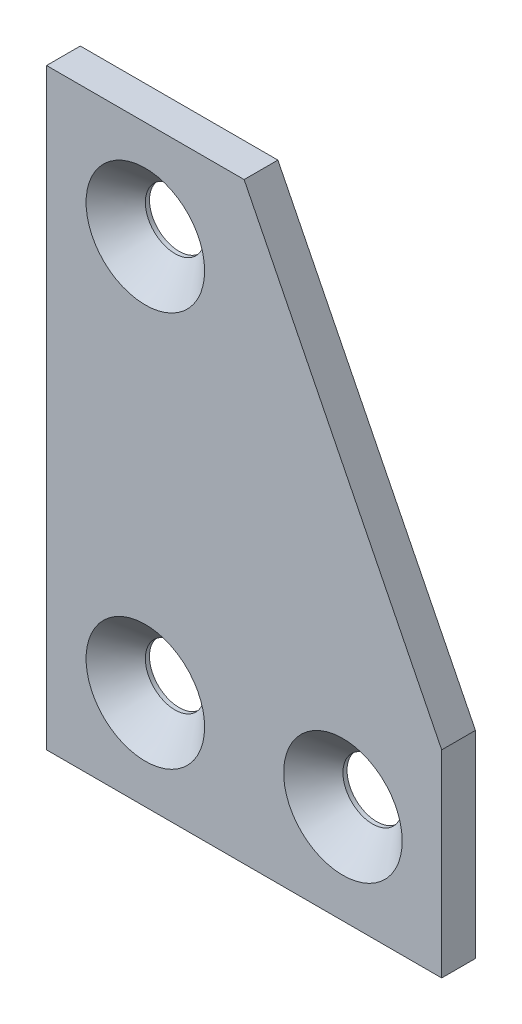
ISO-10303-21;
HEADER;
FILE_DESCRIPTION(('STEP AP214'),'2;1');
FILE_NAME('part.step','',(''),(''),'','','');
FILE_SCHEMA(('AUTOMOTIVE_DESIGN { 1 0 10303 214 1 1 1 1 }'));
ENDSEC;
DATA;
#1=APPLICATION_CONTEXT('core data for automotive mechanical design processes');
#2=APPLICATION_PROTOCOL_DEFINITION('international standard','automotive_design',2000,#1);
#3=PRODUCT_CONTEXT('',#1,'mechanical');
#4=PRODUCT('Part','Part','',(#3));
#5=PRODUCT_RELATED_PRODUCT_CATEGORY('part','',(#4));
#6=PRODUCT_DEFINITION_FORMATION('','',#4);
#7=PRODUCT_DEFINITION_CONTEXT('part definition',#1,'design');
#8=PRODUCT_DEFINITION('design','',#6,#7);
#9=PRODUCT_DEFINITION_SHAPE('','',#8);
#10=(LENGTH_UNIT() NAMED_UNIT(*) SI_UNIT(.MILLI.,.METRE.));
#11=(NAMED_UNIT(*) PLANE_ANGLE_UNIT() SI_UNIT($,.RADIAN.));
#12=(NAMED_UNIT(*) SI_UNIT($,.STERADIAN.) SOLID_ANGLE_UNIT());
#13=UNCERTAINTY_MEASURE_WITH_UNIT(LENGTH_MEASURE(1.E-05),#10,'distance_accuracy_value','');
#14=(GEOMETRIC_REPRESENTATION_CONTEXT(3) GLOBAL_UNCERTAINTY_ASSIGNED_CONTEXT((#13)) GLOBAL_UNIT_ASSIGNED_CONTEXT((#10,
#11,#12)) REPRESENTATION_CONTEXT('',''));
#15=CARTESIAN_POINT('',(0.,0.,0.));
#16=DIRECTION('',(0.,0.,1.));
#17=DIRECTION('',(1.,0.,0.));
#18=AXIS2_PLACEMENT_3D('',#15,#16,#17);
#19=CARTESIAN_POINT('',(0.,30.,1.708));
#20=DIRECTION('',(-0.894427190999916,-0.447213595499958,0.));
#21=DIRECTION('',(0.447213595499958,-0.894427190999916,0.));
#22=AXIS2_PLACEMENT_3D('',#19,#20,#21);
#23=PLANE('',#22);
#24=DIRECTION('',(-0.447213595499958,0.894427190999916,0.));
#25=VECTOR('',#24,1.);
#26=CARTESIAN_POINT('',(0.,30.,-1.708));
#27=LINE('',#26,#25);
#28=CARTESIAN_POINT('',(20.,-9.99999999999999,-1.708));
#29=VERTEX_POINT('',#28);
#30=CARTESIAN_POINT('',(0.,30.,-1.708));
#31=VERTEX_POINT('',#30);
#32=EDGE_CURVE('E128',#29,#31,#27,.T.);
#33=ORIENTED_EDGE('',*,*,#32,.T.);
#34=DIRECTION('',(0.,0.,-1.));
#35=VECTOR('',#34,1.);
#36=CARTESIAN_POINT('',(0.,30.,1.708));
#37=LINE('',#36,#35);
#38=CARTESIAN_POINT('',(0.,30.,1.708));
#39=VERTEX_POINT('',#38);
#40=EDGE_CURVE('E149',#39,#31,#37,.T.);
#41=ORIENTED_EDGE('',*,*,#40,.F.);
#42=DIRECTION('',(-0.447213595499958,0.894427190999916,0.));
#43=VECTOR('',#42,1.);
#44=CARTESIAN_POINT('',(0.,30.,1.708));
#45=LINE('',#44,#43);
#46=CARTESIAN_POINT('',(20.,-9.99999999999999,1.708));
#47=VERTEX_POINT('',#46);
#48=EDGE_CURVE('E142',#47,#39,#45,.T.);
#49=ORIENTED_EDGE('',*,*,#48,.F.);
#50=DIRECTION('',(0.,0.,-1.));
#51=VECTOR('',#50,1.);
#52=CARTESIAN_POINT('',(20.,-9.99999999999999,1.708));
#53=LINE('',#52,#51);
#54=EDGE_CURVE('E124',#47,#29,#53,.T.);
#55=ORIENTED_EDGE('',*,*,#54,.T.);
#56=EDGE_LOOP('',(#33,#41,#49,#55));
#57=FACE_BOUND('',#56,.T.);
#58=ADVANCED_FACE('F45',(#57),#23,.F.);
#59=CARTESIAN_POINT('',(-20.,30.,1.708));
#60=DIRECTION('',(0.,-1.,0.));
#61=DIRECTION('',(0.,0.,-1.));
#62=AXIS2_PLACEMENT_3D('',#59,#60,#61);
#63=PLANE('',#62);
#64=DIRECTION('',(-1.,0.,0.));
#65=VECTOR('',#64,1.);
#66=CARTESIAN_POINT('',(-20.,30.,-1.708));
#67=LINE('',#66,#65);
#68=CARTESIAN_POINT('',(-20.,30.,-1.708));
#69=VERTEX_POINT('',#68);
#70=EDGE_CURVE('E132',#31,#69,#67,.T.);
#71=ORIENTED_EDGE('',*,*,#70,.T.);
#72=DIRECTION('',(0.,0.,-1.));
#73=VECTOR('',#72,1.);
#74=CARTESIAN_POINT('',(-20.,30.,1.708));
#75=LINE('',#74,#73);
#76=CARTESIAN_POINT('',(-20.,30.,1.708));
#77=VERTEX_POINT('',#76);
#78=EDGE_CURVE('E117',#77,#69,#75,.T.);
#79=ORIENTED_EDGE('',*,*,#78,.F.);
#80=DIRECTION('',(-1.,0.,0.));
#81=VECTOR('',#80,1.);
#82=CARTESIAN_POINT('',(-20.,30.,1.708));
#83=LINE('',#82,#81);
#84=EDGE_CURVE('E99',#39,#77,#83,.T.);
#85=ORIENTED_EDGE('',*,*,#84,.F.);
#86=ORIENTED_EDGE('',*,*,#40,.T.);
#87=EDGE_LOOP('',(#71,#79,#85,#86));
#88=FACE_BOUND('',#87,.T.);
#89=ADVANCED_FACE('F189',(#88),#63,.F.);
#90=CARTESIAN_POINT('',(-20.,-30.,1.708));
#91=DIRECTION('',(1.,0.,0.));
#92=DIRECTION('',(0.,0.,-1.));
#93=AXIS2_PLACEMENT_3D('',#90,#91,#92);
#94=PLANE('',#93);
#95=DIRECTION('',(0.,-1.,0.));
#96=VECTOR('',#95,1.);
#97=CARTESIAN_POINT('',(-20.,-30.,-1.708));
#98=LINE('',#97,#96);
#99=CARTESIAN_POINT('',(-20.,-30.,-1.708));
#100=VERTEX_POINT('',#99);
#101=EDGE_CURVE('E115',#69,#100,#98,.T.);
#102=ORIENTED_EDGE('',*,*,#101,.T.);
#103=DIRECTION('',(0.,0.,-1.));
#104=VECTOR('',#103,1.);
#105=CARTESIAN_POINT('',(-20.,-30.,1.708));
#106=LINE('',#105,#104);
#107=CARTESIAN_POINT('',(-20.,-30.,1.708));
#108=VERTEX_POINT('',#107);
#109=EDGE_CURVE('E112',#108,#100,#106,.T.);
#110=ORIENTED_EDGE('',*,*,#109,.F.);
#111=DIRECTION('',(0.,-1.,0.));
#112=VECTOR('',#111,1.);
#113=CARTESIAN_POINT('',(-20.,-30.,1.708));
#114=LINE('',#113,#112);
#115=EDGE_CURVE('E103',#77,#108,#114,.T.);
#116=ORIENTED_EDGE('',*,*,#115,.F.);
#117=ORIENTED_EDGE('',*,*,#78,.T.);
#118=EDGE_LOOP('',(#102,#110,#116,#117));
#119=FACE_BOUND('',#118,.T.);
#120=ADVANCED_FACE('F113',(#119),#94,.F.);
#121=CARTESIAN_POINT('',(-20.,-30.,1.708));
#122=DIRECTION('',(0.,1.,0.));
#123=DIRECTION('',(-1.,0.,0.));
#124=AXIS2_PLACEMENT_3D('',#121,#122,#123);
#125=PLANE('',#124);
#126=DIRECTION('',(1.,0.,0.));
#127=VECTOR('',#126,1.);
#128=CARTESIAN_POINT('',(-20.,-30.,-1.708));
#129=LINE('',#128,#127);
#130=CARTESIAN_POINT('',(20.,-30.,-1.708));
#131=VERTEX_POINT('',#130);
#132=EDGE_CURVE('E84',#100,#131,#129,.T.);
#133=ORIENTED_EDGE('',*,*,#132,.T.);
#134=DIRECTION('',(0.,0.,-1.));
#135=VECTOR('',#134,1.);
#136=CARTESIAN_POINT('',(20.,-30.,1.708));
#137=LINE('',#136,#135);
#138=CARTESIAN_POINT('',(20.,-30.,1.708));
#139=VERTEX_POINT('',#138);
#140=EDGE_CURVE('E118',#139,#131,#137,.T.);
#141=ORIENTED_EDGE('',*,*,#140,.F.);
#142=DIRECTION('',(1.,0.,0.));
#143=VECTOR('',#142,1.);
#144=CARTESIAN_POINT('',(-20.,-30.,1.708));
#145=LINE('',#144,#143);
#146=EDGE_CURVE('E107',#108,#139,#145,.T.);
#147=ORIENTED_EDGE('',*,*,#146,.F.);
#148=ORIENTED_EDGE('',*,*,#109,.T.);
#149=EDGE_LOOP('',(#133,#141,#147,#148));
#150=FACE_BOUND('',#149,.T.);
#151=ADVANCED_FACE('F120',(#150),#125,.F.);
#152=CARTESIAN_POINT('',(20.,-30.,1.708));
#153=DIRECTION('',(-1.,0.,0.));
#154=DIRECTION('',(0.,-1.,0.));
#155=AXIS2_PLACEMENT_3D('',#152,#153,#154);
#156=PLANE('',#155);
#157=DIRECTION('',(0.,1.,0.));
#158=VECTOR('',#157,1.);
#159=CARTESIAN_POINT('',(20.,-30.,-1.708));
#160=LINE('',#159,#158);
#161=EDGE_CURVE('E90',#131,#29,#160,.T.);
#162=ORIENTED_EDGE('',*,*,#161,.T.);
#163=ORIENTED_EDGE('',*,*,#54,.F.);
#164=DIRECTION('',(0.,1.,0.));
#165=VECTOR('',#164,1.);
#166=CARTESIAN_POINT('',(20.,-30.,1.708));
#167=LINE('',#166,#165);
#168=EDGE_CURVE('E64',#139,#47,#167,.T.);
#169=ORIENTED_EDGE('',*,*,#168,.F.);
#170=ORIENTED_EDGE('',*,*,#140,.T.);
#171=EDGE_LOOP('',(#162,#163,#169,#170));
#172=FACE_BOUND('',#171,.T.);
#173=ADVANCED_FACE('F208',(#172),#156,.F.);
#174=CARTESIAN_POINT('',(0.,0.,1.708));
#175=DIRECTION('',(0.,0.,1.));
#176=DIRECTION('',(1.,0.,0.));
#177=AXIS2_PLACEMENT_3D('',#174,#175,#176);
#178=PLANE('',#177);
#179=CARTESIAN_POINT('',(10.,-20.,1.708));
#180=DIRECTION('',(0.,0.,1.));
#181=DIRECTION('',(1.,0.,0.));
#182=AXIS2_PLACEMENT_3D('',#179,#180,#181);
#183=CIRCLE('',#182,6.00000000000001);
#184=CARTESIAN_POINT('',(16.,-20.,1.708));
#185=VERTEX_POINT('',#184);
#186=EDGE_CURVE('E164',#185,#185,#183,.F.);
#187=ORIENTED_EDGE('',*,*,#186,.T.);
#188=EDGE_LOOP('',(#187));
#189=FACE_BOUND('',#188,.T.);
#190=CARTESIAN_POINT('',(-9.99999999999999,-20.,1.708));
#191=DIRECTION('',(0.,0.,1.));
#192=DIRECTION('',(1.,0.,0.));
#193=AXIS2_PLACEMENT_3D('',#190,#191,#192);
#194=CIRCLE('',#193,6.00000000000001);
#195=CARTESIAN_POINT('',(-3.99999999999998,-20.,1.708));
#196=VERTEX_POINT('',#195);
#197=EDGE_CURVE('E160',#196,#196,#194,.F.);
#198=ORIENTED_EDGE('',*,*,#197,.T.);
#199=EDGE_LOOP('',(#198));
#200=FACE_BOUND('',#199,.T.);
#201=CARTESIAN_POINT('',(-10.,20.,1.708));
#202=DIRECTION('',(0.,0.,1.));
#203=DIRECTION('',(1.,0.,0.));
#204=AXIS2_PLACEMENT_3D('',#201,#202,#203);
#205=CIRCLE('',#204,6.00000000000001);
#206=CARTESIAN_POINT('',(-3.99999999999999,20.,1.708));
#207=VERTEX_POINT('',#206);
#208=EDGE_CURVE('E156',#207,#207,#205,.F.);
#209=ORIENTED_EDGE('',*,*,#208,.T.);
#210=EDGE_LOOP('',(#209));
#211=FACE_BOUND('',#210,.T.);
#212=ORIENTED_EDGE('',*,*,#48,.T.);
#213=ORIENTED_EDGE('',*,*,#84,.T.);
#214=ORIENTED_EDGE('',*,*,#115,.T.);
#215=ORIENTED_EDGE('',*,*,#146,.T.);
#216=ORIENTED_EDGE('',*,*,#168,.T.);
#217=EDGE_LOOP('',(#212,#213,#214,#215,#216));
#218=FACE_BOUND('',#217,.T.);
#219=ADVANCED_FACE('F105',(#189,#200,#211,#218),#178,.T.);
#220=CARTESIAN_POINT('',(0.,0.,-1.708));
#221=DIRECTION('',(0.,0.,1.));
#222=DIRECTION('',(1.,0.,0.));
#223=AXIS2_PLACEMENT_3D('',#220,#221,#222);
#224=PLANE('',#223);
#225=CARTESIAN_POINT('',(-10.,20.,-1.708));
#226=DIRECTION('',(0.,0.,1.));
#227=DIRECTION('',(1.,0.,0.));
#228=AXIS2_PLACEMENT_3D('',#225,#226,#227);
#229=CIRCLE('',#228,3.);
#230=CARTESIAN_POINT('',(-7.,20.,-1.708));
#231=VERTEX_POINT('',#230);
#232=EDGE_CURVE('E133',#231,#231,#229,.T.);
#233=ORIENTED_EDGE('',*,*,#232,.T.);
#234=EDGE_LOOP('',(#233));
#235=FACE_BOUND('',#234,.T.);
#236=CARTESIAN_POINT('',(-9.99999999999999,-20.,-1.708));
#237=DIRECTION('',(0.,0.,1.));
#238=DIRECTION('',(1.,0.,0.));
#239=AXIS2_PLACEMENT_3D('',#236,#237,#238);
#240=CIRCLE('',#239,3.);
#241=CARTESIAN_POINT('',(-7.,-20.,-1.708));
#242=VERTEX_POINT('',#241);
#243=EDGE_CURVE('E233',#242,#242,#240,.T.);
#244=ORIENTED_EDGE('',*,*,#243,.T.);
#245=EDGE_LOOP('',(#244));
#246=FACE_BOUND('',#245,.T.);
#247=CARTESIAN_POINT('',(10.,-20.,-1.708));
#248=DIRECTION('',(0.,0.,1.));
#249=DIRECTION('',(1.,0.,0.));
#250=AXIS2_PLACEMENT_3D('',#247,#248,#249);
#251=CIRCLE('',#250,3.);
#252=CARTESIAN_POINT('',(13.,-20.,-1.708));
#253=VERTEX_POINT('',#252);
#254=EDGE_CURVE('E237',#253,#253,#251,.T.);
#255=ORIENTED_EDGE('',*,*,#254,.T.);
#256=EDGE_LOOP('',(#255));
#257=FACE_BOUND('',#256,.T.);
#258=ORIENTED_EDGE('',*,*,#32,.F.);
#259=ORIENTED_EDGE('',*,*,#161,.F.);
#260=ORIENTED_EDGE('',*,*,#132,.F.);
#261=ORIENTED_EDGE('',*,*,#101,.F.);
#262=ORIENTED_EDGE('',*,*,#70,.F.);
#263=EDGE_LOOP('',(#258,#259,#260,#261,#262));
#264=FACE_BOUND('',#263,.T.);
#265=ADVANCED_FACE('F211',(#235,#246,#257,#264),#224,.F.);
#266=CARTESIAN_POINT('',(10.,-20.,-1.708));
#267=DIRECTION('',(0.,0.,1.));
#268=DIRECTION('',(1.,0.,0.));
#269=AXIS2_PLACEMENT_3D('',#266,#267,#268);
#270=CYLINDRICAL_SURFACE('',#269,3.);
#271=CARTESIAN_POINT('',(10.,-20.,-1.292));
#272=DIRECTION('',(0.,0.,1.));
#273=DIRECTION('',(1.,0.,0.));
#274=AXIS2_PLACEMENT_3D('',#271,#272,#273);
#275=CIRCLE('',#274,3.);
#276=CARTESIAN_POINT('',(13.,-20.,-1.292));
#277=VERTEX_POINT('',#276);
#278=EDGE_CURVE('E152',#277,#277,#275,.T.);
#279=ORIENTED_EDGE('',*,*,#278,.T.);
#280=EDGE_LOOP('',(#279));
#281=FACE_BOUND('',#280,.T.);
#282=ORIENTED_EDGE('',*,*,#254,.F.);
#283=EDGE_LOOP('',(#282));
#284=FACE_BOUND('',#283,.T.);
#285=ADVANCED_FACE('F214',(#281,#284),#270,.F.);
#286=CARTESIAN_POINT('',(-9.99999999999999,-20.,-1.708));
#287=DIRECTION('',(0.,0.,1.));
#288=DIRECTION('',(1.,0.,0.));
#289=AXIS2_PLACEMENT_3D('',#286,#287,#288);
#290=CYLINDRICAL_SURFACE('',#289,3.);
#291=CARTESIAN_POINT('',(-9.99999999999999,-20.,-1.292));
#292=DIRECTION('',(0.,0.,1.));
#293=DIRECTION('',(1.,0.,0.));
#294=AXIS2_PLACEMENT_3D('',#291,#292,#293);
#295=CIRCLE('',#294,3.);
#296=CARTESIAN_POINT('',(-7.,-20.,-1.292));
#297=VERTEX_POINT('',#296);
#298=EDGE_CURVE('E56',#297,#297,#295,.T.);
#299=ORIENTED_EDGE('',*,*,#298,.T.);
#300=EDGE_LOOP('',(#299));
#301=FACE_BOUND('',#300,.T.);
#302=ORIENTED_EDGE('',*,*,#243,.F.);
#303=EDGE_LOOP('',(#302));
#304=FACE_BOUND('',#303,.T.);
#305=ADVANCED_FACE('F171',(#301,#304),#290,.F.);
#306=CARTESIAN_POINT('',(-10.,20.,-1.708));
#307=DIRECTION('',(0.,0.,1.));
#308=DIRECTION('',(1.,0.,0.));
#309=AXIS2_PLACEMENT_3D('',#306,#307,#308);
#310=CYLINDRICAL_SURFACE('',#309,3.);
#311=CARTESIAN_POINT('',(-10.,20.,-1.292));
#312=DIRECTION('',(0.,0.,1.));
#313=DIRECTION('',(1.,0.,0.));
#314=AXIS2_PLACEMENT_3D('',#311,#312,#313);
#315=CIRCLE('',#314,3.);
#316=CARTESIAN_POINT('',(-7.,20.,-1.292));
#317=VERTEX_POINT('',#316);
#318=EDGE_CURVE('E11',#317,#317,#315,.T.);
#319=ORIENTED_EDGE('',*,*,#318,.T.);
#320=EDGE_LOOP('',(#319));
#321=FACE_BOUND('',#320,.T.);
#322=ORIENTED_EDGE('',*,*,#232,.F.);
#323=EDGE_LOOP('',(#322));
#324=FACE_BOUND('',#323,.T.);
#325=ADVANCED_FACE('F183',(#321,#324),#310,.F.);
#326=CARTESIAN_POINT('',(10.,-20.,-1.292));
#327=DIRECTION('',(0.,0.,1.));
#328=DIRECTION('',(1.,0.,0.));
#329=AXIS2_PLACEMENT_3D('',#326,#327,#328);
#330=CONICAL_SURFACE('',#329,3.,0.78539816339745);
#331=ORIENTED_EDGE('',*,*,#186,.F.);
#332=EDGE_LOOP('',(#331));
#333=FACE_BOUND('',#332,.T.);
#334=ORIENTED_EDGE('',*,*,#278,.F.);
#335=EDGE_LOOP('',(#334));
#336=FACE_BOUND('',#335,.T.);
#337=ADVANCED_FACE('F176',(#333,#336),#330,.F.);
#338=CARTESIAN_POINT('',(-9.99999999999999,-20.,-1.292));
#339=DIRECTION('',(0.,0.,1.));
#340=DIRECTION('',(1.,0.,0.));
#341=AXIS2_PLACEMENT_3D('',#338,#339,#340);
#342=CONICAL_SURFACE('',#341,3.,0.78539816339745);
#343=ORIENTED_EDGE('',*,*,#197,.F.);
#344=EDGE_LOOP('',(#343));
#345=FACE_BOUND('',#344,.T.);
#346=ORIENTED_EDGE('',*,*,#298,.F.);
#347=EDGE_LOOP('',(#346));
#348=FACE_BOUND('',#347,.T.);
#349=ADVANCED_FACE('F174',(#345,#348),#342,.F.);
#350=CARTESIAN_POINT('',(-10.,20.,-1.292));
#351=DIRECTION('',(0.,0.,1.));
#352=DIRECTION('',(1.,0.,0.));
#353=AXIS2_PLACEMENT_3D('',#350,#351,#352);
#354=CONICAL_SURFACE('',#353,3.,0.78539816339745);
#355=ORIENTED_EDGE('',*,*,#208,.F.);
#356=EDGE_LOOP('',(#355));
#357=FACE_BOUND('',#356,.T.);
#358=ORIENTED_EDGE('',*,*,#318,.F.);
#359=EDGE_LOOP('',(#358));
#360=FACE_BOUND('',#359,.T.);
#361=ADVANCED_FACE('F48',(#357,#360),#354,.F.);
#362=CLOSED_SHELL('',(#58,#89,#120,#151,#173,#219,#265,#285,#305,#325,#337,#349,#361));
#363=MANIFOLD_SOLID_BREP('B2',#362);
#364=ADVANCED_BREP_SHAPE_REPRESENTATION('',(#18,#363),#14);
#365=SHAPE_DEFINITION_REPRESENTATION(#9,#364);
ENDSEC;
END-ISO-10303-21;
